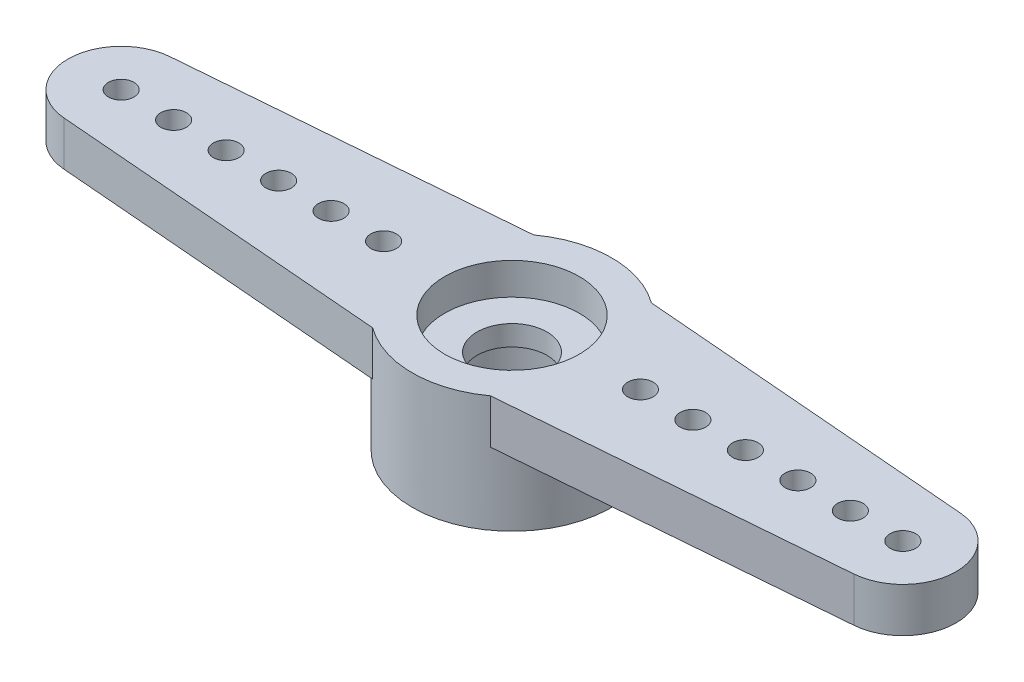
ISO-10303-21;
HEADER;
FILE_DESCRIPTION(('STEP AP214'),'2;1');
FILE_NAME('part.step','',(''),(''),'','','');
FILE_SCHEMA(('AUTOMOTIVE_DESIGN { 1 0 10303 214 1 1 1 1 }'));
ENDSEC;
DATA;
#1=APPLICATION_CONTEXT('core data for automotive mechanical design processes');
#2=APPLICATION_PROTOCOL_DEFINITION('international standard','automotive_design',2000,#1);
#3=PRODUCT_CONTEXT('',#1,'mechanical');
#4=PRODUCT('Part','Part','',(#3));
#5=PRODUCT_RELATED_PRODUCT_CATEGORY('part','',(#4));
#6=PRODUCT_DEFINITION_FORMATION('','',#4);
#7=PRODUCT_DEFINITION_CONTEXT('part definition',#1,'design');
#8=PRODUCT_DEFINITION('design','',#6,#7);
#9=PRODUCT_DEFINITION_SHAPE('','',#8);
#10=(LENGTH_UNIT() NAMED_UNIT(*) SI_UNIT(.MILLI.,.METRE.));
#11=(NAMED_UNIT(*) PLANE_ANGLE_UNIT() SI_UNIT($,.RADIAN.));
#12=(NAMED_UNIT(*) SI_UNIT($,.STERADIAN.) SOLID_ANGLE_UNIT());
#13=UNCERTAINTY_MEASURE_WITH_UNIT(LENGTH_MEASURE(1.E-05),#10,'distance_accuracy_value','');
#14=(GEOMETRIC_REPRESENTATION_CONTEXT(3) GLOBAL_UNCERTAINTY_ASSIGNED_CONTEXT((#13)) GLOBAL_UNIT_ASSIGNED_CONTEXT((#10,
#11,#12)) REPRESENTATION_CONTEXT('',''));
#15=CARTESIAN_POINT('',(0.,0.,0.));
#16=DIRECTION('',(0.,0.,1.));
#17=DIRECTION('',(1.,0.,0.));
#18=AXIS2_PLACEMENT_3D('',#15,#16,#17);
#19=CARTESIAN_POINT('',(0.,-2.6162,0.));
#20=DIRECTION('',(0.,1.,0.));
#21=DIRECTION('',(0.,0.,1.));
#22=AXIS2_PLACEMENT_3D('',#19,#20,#21);
#23=CYLINDRICAL_SURFACE('',#22,1.27);
#24=CARTESIAN_POINT('',(0.,0.4572,0.));
#25=DIRECTION('',(0.,1.,0.));
#26=DIRECTION('',(0.,0.,1.));
#27=AXIS2_PLACEMENT_3D('',#24,#25,#26);
#28=CIRCLE('',#27,1.27);
#29=CARTESIAN_POINT('',(0.,0.4572,1.27));
#30=VERTEX_POINT('',#29);
#31=EDGE_CURVE('E178',#30,#30,#28,.F.);
#32=ORIENTED_EDGE('',*,*,#31,.F.);
#33=EDGE_LOOP('',(#32));
#34=FACE_BOUND('',#33,.T.);
#35=CARTESIAN_POINT('',(0.,-0.2794,0.));
#36=DIRECTION('',(0.,-1.,0.));
#37=DIRECTION('',(0.,0.,-1.));
#38=AXIS2_PLACEMENT_3D('',#35,#36,#37);
#39=CIRCLE('',#38,1.27);
#40=CARTESIAN_POINT('',(0.,-0.2794,-1.27));
#41=VERTEX_POINT('',#40);
#42=EDGE_CURVE('E38',#41,#41,#39,.F.);
#43=ORIENTED_EDGE('',*,*,#42,.F.);
#44=EDGE_LOOP('',(#43));
#45=FACE_BOUND('',#44,.T.);
#46=ADVANCED_FACE('F34',(#34,#45),#23,.F.);
#47=CARTESIAN_POINT('',(0.,0.,0.));
#48=DIRECTION('',(0.,1.,0.));
#49=DIRECTION('',(0.,0.,1.));
#50=AXIS2_PLACEMENT_3D('',#47,#48,#49);
#51=PLANE('',#50);
#52=CARTESIAN_POINT('',(10.3759,0.,0.));
#53=DIRECTION('',(0.,1.,0.));
#54=DIRECTION('',(0.,0.,1.));
#55=AXIS2_PLACEMENT_3D('',#52,#53,#54);
#56=CIRCLE('',#55,0.46355);
#57=CARTESIAN_POINT('',(10.3759,0.,0.46355));
#58=VERTEX_POINT('',#57);
#59=EDGE_CURVE('E203',#58,#58,#56,.F.);
#60=ORIENTED_EDGE('',*,*,#59,.F.);
#61=EDGE_LOOP('',(#60));
#62=FACE_BOUND('',#61,.T.);
#63=CARTESIAN_POINT('',(6.5659,0.,0.));
#64=DIRECTION('',(0.,1.,0.));
#65=DIRECTION('',(0.,0.,1.));
#66=AXIS2_PLACEMENT_3D('',#63,#64,#65);
#67=CIRCLE('',#66,0.46355);
#68=CARTESIAN_POINT('',(6.5659,0.,0.46355));
#69=VERTEX_POINT('',#68);
#70=EDGE_CURVE('E215',#69,#69,#67,.F.);
#71=ORIENTED_EDGE('',*,*,#70,.F.);
#72=EDGE_LOOP('',(#71));
#73=FACE_BOUND('',#72,.T.);
#74=CARTESIAN_POINT('',(14.1859,0.,0.));
#75=DIRECTION('',(0.,1.,0.));
#76=DIRECTION('',(0.,0.,1.));
#77=AXIS2_PLACEMENT_3D('',#74,#75,#76);
#78=CIRCLE('',#77,0.46355);
#79=CARTESIAN_POINT('',(14.1859,0.,0.463550000000002));
#80=VERTEX_POINT('',#79);
#81=EDGE_CURVE('E227',#80,#80,#78,.F.);
#82=ORIENTED_EDGE('',*,*,#81,.F.);
#83=EDGE_LOOP('',(#82));
#84=FACE_BOUND('',#83,.T.);
#85=DIRECTION('',(0.996680450541178,0.,-0.0814130180562945));
#86=VECTOR('',#85,1.);
#87=CARTESIAN_POINT('',(14.3430596900559,0.,1.92399194172469));
#88=LINE('',#87,#86);
#89=CARTESIAN_POINT('',(2.13741415032277,0.,2.921));
#90=VERTEX_POINT('',#89);
#91=CARTESIAN_POINT('',(14.3430596900559,0.,1.92399194172469));
#92=VERTEX_POINT('',#91);
#93=EDGE_CURVE('E125',#90,#92,#88,.T.);
#94=ORIENTED_EDGE('',*,*,#93,.F.);
#95=CARTESIAN_POINT('',(0.,0.,0.));
#96=DIRECTION('',(0.,1.,0.));
#97=DIRECTION('',(0.,0.,1.));
#98=AXIS2_PLACEMENT_3D('',#95,#96,#97);
#99=CIRCLE('',#98,3.6195);
#100=CARTESIAN_POINT('',(2.13741415032277,0.,-2.921));
#101=VERTEX_POINT('',#100);
#102=EDGE_CURVE('E11',#90,#101,#99,.T.);
#103=ORIENTED_EDGE('',*,*,#102,.T.);
#104=DIRECTION('',(-0.996680450541178,0.,-0.0814130180562945));
#105=VECTOR('',#104,1.);
#106=CARTESIAN_POINT('',(2.13741415032277,0.,-2.921));
#107=LINE('',#106,#105);
#108=CARTESIAN_POINT('',(14.3430596900559,0.,-1.92399194172469));
#109=VERTEX_POINT('',#108);
#110=EDGE_CURVE('E130',#109,#101,#107,.T.);
#111=ORIENTED_EDGE('',*,*,#110,.F.);
#112=CARTESIAN_POINT('',(14.1859,0.,0.));
#113=DIRECTION('',(0.,1.,0.));
#114=DIRECTION('',(0.,0.,-1.));
#115=AXIS2_PLACEMENT_3D('',#112,#113,#114);
#116=CIRCLE('',#115,1.9304);
#117=EDGE_CURVE('E127',#92,#109,#116,.T.);
#118=ORIENTED_EDGE('',*,*,#117,.F.);
#119=EDGE_LOOP('',(#94,#103,#111,#118));
#120=FACE_BOUND('',#119,.T.);
#121=CARTESIAN_POINT('',(4.6609,0.,0.));
#122=DIRECTION('',(0.,1.,0.));
#123=DIRECTION('',(0.,0.,1.));
#124=AXIS2_PLACEMENT_3D('',#121,#122,#123);
#125=CIRCLE('',#124,0.46355);
#126=CARTESIAN_POINT('',(4.6609,0.,0.46355));
#127=VERTEX_POINT('',#126);
#128=EDGE_CURVE('E221',#127,#127,#125,.F.);
#129=ORIENTED_EDGE('',*,*,#128,.F.);
#130=EDGE_LOOP('',(#129));
#131=FACE_BOUND('',#130,.T.);
#132=CARTESIAN_POINT('',(8.4709,0.,0.));
#133=DIRECTION('',(0.,1.,0.));
#134=DIRECTION('',(0.,0.,1.));
#135=AXIS2_PLACEMENT_3D('',#132,#133,#134);
#136=CIRCLE('',#135,0.46355);
#137=CARTESIAN_POINT('',(8.4709,0.,0.46355));
#138=VERTEX_POINT('',#137);
#139=EDGE_CURVE('E209',#138,#138,#136,.F.);
#140=ORIENTED_EDGE('',*,*,#139,.F.);
#141=EDGE_LOOP('',(#140));
#142=FACE_BOUND('',#141,.T.);
#143=CARTESIAN_POINT('',(12.2809,0.,0.));
#144=DIRECTION('',(0.,1.,0.));
#145=DIRECTION('',(0.,0.,1.));
#146=AXIS2_PLACEMENT_3D('',#143,#144,#145);
#147=CIRCLE('',#146,0.46355);
#148=CARTESIAN_POINT('',(12.2809,0.,0.46355));
#149=VERTEX_POINT('',#148);
#150=EDGE_CURVE('E185',#149,#149,#147,.F.);
#151=ORIENTED_EDGE('',*,*,#150,.F.);
#152=EDGE_LOOP('',(#151));
#153=FACE_BOUND('',#152,.T.);
#154=ADVANCED_FACE('F275',(#62,#73,#84,#120,#131,#142,#153),#51,.F.);
#155=CARTESIAN_POINT('',(0.,1.6129,0.));
#156=DIRECTION('',(0.,1.,0.));
#157=DIRECTION('',(0.,0.,1.));
#158=AXIS2_PLACEMENT_3D('',#155,#156,#157);
#159=PLANE('',#158);
#160=CARTESIAN_POINT('',(0.,1.6129,0.));
#161=DIRECTION('',(0.,1.,0.));
#162=DIRECTION('',(0.,0.,1.));
#163=AXIS2_PLACEMENT_3D('',#160,#161,#162);
#164=CIRCLE('',#163,2.44475);
#165=CARTESIAN_POINT('',(0.,1.6129,2.44475));
#166=VERTEX_POINT('',#165);
#167=EDGE_CURVE('E188',#166,#166,#164,.T.);
#168=ORIENTED_EDGE('',*,*,#167,.F.);
#169=EDGE_LOOP('',(#168));
#170=FACE_BOUND('',#169,.T.);
#171=CARTESIAN_POINT('',(10.3759,1.6129,0.));
#172=DIRECTION('',(0.,-1.,0.));
#173=DIRECTION('',(0.,0.,1.));
#174=AXIS2_PLACEMENT_3D('',#171,#172,#173);
#175=CIRCLE('',#174,0.46355);
#176=CARTESIAN_POINT('',(10.3759,1.6129,0.46355));
#177=VERTEX_POINT('',#176);
#178=EDGE_CURVE('E200',#177,#177,#175,.T.);
#179=ORIENTED_EDGE('',*,*,#178,.T.);
#180=EDGE_LOOP('',(#179));
#181=FACE_BOUND('',#180,.T.);
#182=CARTESIAN_POINT('',(6.5659,1.6129,0.));
#183=DIRECTION('',(0.,-1.,0.));
#184=DIRECTION('',(0.,0.,1.));
#185=AXIS2_PLACEMENT_3D('',#182,#183,#184);
#186=CIRCLE('',#185,0.46355);
#187=CARTESIAN_POINT('',(6.5659,1.6129,0.46355));
#188=VERTEX_POINT('',#187);
#189=EDGE_CURVE('E212',#188,#188,#186,.T.);
#190=ORIENTED_EDGE('',*,*,#189,.T.);
#191=EDGE_LOOP('',(#190));
#192=FACE_BOUND('',#191,.T.);
#193=CARTESIAN_POINT('',(14.1859,1.6129,0.));
#194=DIRECTION('',(0.,-1.,0.));
#195=DIRECTION('',(0.,0.,1.));
#196=AXIS2_PLACEMENT_3D('',#193,#194,#195);
#197=CIRCLE('',#196,0.46355);
#198=CARTESIAN_POINT('',(14.1859,1.6129,0.463550000000002));
#199=VERTEX_POINT('',#198);
#200=EDGE_CURVE('E224',#199,#199,#197,.T.);
#201=ORIENTED_EDGE('',*,*,#200,.T.);
#202=EDGE_LOOP('',(#201));
#203=FACE_BOUND('',#202,.T.);
#204=CARTESIAN_POINT('',(-12.2809,1.6129,0.));
#205=DIRECTION('',(0.,1.,0.));
#206=DIRECTION('',(0.,0.,1.));
#207=AXIS2_PLACEMENT_3D('',#204,#205,#206);
#208=CIRCLE('',#207,0.46355);
#209=CARTESIAN_POINT('',(-12.2809,1.6129,0.46355));
#210=VERTEX_POINT('',#209);
#211=EDGE_CURVE('E177',#210,#210,#208,.T.);
#212=ORIENTED_EDGE('',*,*,#211,.F.);
#213=EDGE_LOOP('',(#212));
#214=FACE_BOUND('',#213,.T.);
#215=CARTESIAN_POINT('',(-10.3759,1.6129,0.));
#216=DIRECTION('',(0.,1.,0.));
#217=DIRECTION('',(0.,0.,1.));
#218=AXIS2_PLACEMENT_3D('',#215,#216,#217);
#219=CIRCLE('',#218,0.46355);
#220=CARTESIAN_POINT('',(-10.3759,1.6129,0.46355));
#221=VERTEX_POINT('',#220);
#222=EDGE_CURVE('E174',#221,#221,#219,.T.);
#223=ORIENTED_EDGE('',*,*,#222,.F.);
#224=EDGE_LOOP('',(#223));
#225=FACE_BOUND('',#224,.T.);
#226=CARTESIAN_POINT('',(-8.4709,1.6129,0.));
#227=DIRECTION('',(0.,1.,0.));
#228=DIRECTION('',(0.,0.,1.));
#229=AXIS2_PLACEMENT_3D('',#226,#227,#228);
#230=CIRCLE('',#229,0.46355);
#231=CARTESIAN_POINT('',(-8.4709,1.6129,0.46355));
#232=VERTEX_POINT('',#231);
#233=EDGE_CURVE('E170',#232,#232,#230,.T.);
#234=ORIENTED_EDGE('',*,*,#233,.F.);
#235=EDGE_LOOP('',(#234));
#236=FACE_BOUND('',#235,.T.);
#237=CARTESIAN_POINT('',(-6.5659,1.6129,0.));
#238=DIRECTION('',(0.,1.,0.));
#239=DIRECTION('',(0.,0.,1.));
#240=AXIS2_PLACEMENT_3D('',#237,#238,#239);
#241=CIRCLE('',#240,0.46355);
#242=CARTESIAN_POINT('',(-6.5659,1.6129,0.46355));
#243=VERTEX_POINT('',#242);
#244=EDGE_CURVE('E166',#243,#243,#241,.T.);
#245=ORIENTED_EDGE('',*,*,#244,.F.);
#246=EDGE_LOOP('',(#245));
#247=FACE_BOUND('',#246,.T.);
#248=CARTESIAN_POINT('',(-4.6609,1.6129,0.));
#249=DIRECTION('',(0.,1.,0.));
#250=DIRECTION('',(0.,0.,1.));
#251=AXIS2_PLACEMENT_3D('',#248,#249,#250);
#252=CIRCLE('',#251,0.46355);
#253=CARTESIAN_POINT('',(-4.6609,1.6129,0.46355));
#254=VERTEX_POINT('',#253);
#255=EDGE_CURVE('E162',#254,#254,#252,.T.);
#256=ORIENTED_EDGE('',*,*,#255,.F.);
#257=EDGE_LOOP('',(#256));
#258=FACE_BOUND('',#257,.T.);
#259=CARTESIAN_POINT('',(-14.1859,1.6129,0.));
#260=DIRECTION('',(0.,1.,0.));
#261=DIRECTION('',(0.,0.,1.));
#262=AXIS2_PLACEMENT_3D('',#259,#260,#261);
#263=CIRCLE('',#262,0.46355);
#264=CARTESIAN_POINT('',(-14.1859,1.6129,0.463550000000002));
#265=VERTEX_POINT('',#264);
#266=EDGE_CURVE('E158',#265,#265,#263,.T.);
#267=ORIENTED_EDGE('',*,*,#266,.F.);
#268=EDGE_LOOP('',(#267));
#269=FACE_BOUND('',#268,.T.);
#270=DIRECTION('',(0.996680450541178,0.,0.0814130180562944));
#271=VECTOR('',#270,1.);
#272=CARTESIAN_POINT('',(-14.3430596900559,1.6129,1.92399194172469));
#273=LINE('',#272,#271);
#274=CARTESIAN_POINT('',(-14.3430596900559,1.6129,1.92399194172469));
#275=VERTEX_POINT('',#274);
#276=CARTESIAN_POINT('',(-2.13741415032276,1.6129,2.921));
#277=VERTEX_POINT('',#276);
#278=EDGE_CURVE('E53',#275,#277,#273,.T.);
#279=ORIENTED_EDGE('',*,*,#278,.T.);
#280=CARTESIAN_POINT('',(0.,1.6129,0.));
#281=DIRECTION('',(0.,1.,0.));
#282=DIRECTION('',(0.,0.,1.));
#283=AXIS2_PLACEMENT_3D('',#280,#281,#282);
#284=CIRCLE('',#283,3.6195);
#285=CARTESIAN_POINT('',(2.13741415032277,1.6129,2.921));
#286=VERTEX_POINT('',#285);
#287=EDGE_CURVE('E138',#277,#286,#284,.T.);
#288=ORIENTED_EDGE('',*,*,#287,.T.);
#289=DIRECTION('',(0.996680450541178,0.,-0.0814130180562945));
#290=VECTOR('',#289,1.);
#291=CARTESIAN_POINT('',(14.3430596900559,1.6129,1.92399194172469));
#292=LINE('',#291,#290);
#293=CARTESIAN_POINT('',(14.3430596900559,1.6129,1.92399194172469));
#294=VERTEX_POINT('',#293);
#295=EDGE_CURVE('E90',#286,#294,#292,.T.);
#296=ORIENTED_EDGE('',*,*,#295,.T.);
#297=CARTESIAN_POINT('',(14.1859,1.6129,0.));
#298=DIRECTION('',(0.,1.,0.));
#299=DIRECTION('',(0.,0.,-1.));
#300=AXIS2_PLACEMENT_3D('',#297,#298,#299);
#301=CIRCLE('',#300,1.9304);
#302=CARTESIAN_POINT('',(14.3430596900559,1.6129,-1.92399194172469));
#303=VERTEX_POINT('',#302);
#304=EDGE_CURVE('E246',#294,#303,#301,.T.);
#305=ORIENTED_EDGE('',*,*,#304,.T.);
#306=DIRECTION('',(-0.996680450541178,0.,-0.0814130180562945));
#307=VECTOR('',#306,1.);
#308=CARTESIAN_POINT('',(2.13741415032277,1.6129,-2.921));
#309=LINE('',#308,#307);
#310=CARTESIAN_POINT('',(2.13741415032277,1.6129,-2.921));
#311=VERTEX_POINT('',#310);
#312=EDGE_CURVE('E248',#303,#311,#309,.T.);
#313=ORIENTED_EDGE('',*,*,#312,.T.);
#314=CARTESIAN_POINT('',(0.,1.6129,0.));
#315=DIRECTION('',(0.,1.,0.));
#316=DIRECTION('',(0.,0.,1.));
#317=AXIS2_PLACEMENT_3D('',#314,#315,#316);
#318=CIRCLE('',#317,3.6195);
#319=CARTESIAN_POINT('',(-2.13741415032276,1.6129,-2.921));
#320=VERTEX_POINT('',#319);
#321=EDGE_CURVE('E111',#311,#320,#318,.T.);
#322=ORIENTED_EDGE('',*,*,#321,.T.);
#323=DIRECTION('',(-0.996680450541178,0.,0.0814130180562946));
#324=VECTOR('',#323,1.);
#325=CARTESIAN_POINT('',(-14.3430596900559,1.6129,-1.92399194172469));
#326=LINE('',#325,#324);
#327=CARTESIAN_POINT('',(-14.3430596900559,1.6129,-1.92399194172469));
#328=VERTEX_POINT('',#327);
#329=EDGE_CURVE('E105',#320,#328,#326,.T.);
#330=ORIENTED_EDGE('',*,*,#329,.T.);
#331=CARTESIAN_POINT('',(-14.1859,1.6129,0.));
#332=DIRECTION('',(0.,1.,0.));
#333=DIRECTION('',(0.,0.,1.));
#334=AXIS2_PLACEMENT_3D('',#331,#332,#333);
#335=CIRCLE('',#334,1.9304);
#336=EDGE_CURVE('E109',#328,#275,#335,.T.);
#337=ORIENTED_EDGE('',*,*,#336,.T.);
#338=EDGE_LOOP('',(#279,#288,#296,#305,#313,#322,#330,#337));
#339=FACE_BOUND('',#338,.T.);
#340=CARTESIAN_POINT('',(4.6609,1.6129,0.));
#341=DIRECTION('',(0.,-1.,0.));
#342=DIRECTION('',(0.,0.,1.));
#343=AXIS2_PLACEMENT_3D('',#340,#341,#342);
#344=CIRCLE('',#343,0.46355);
#345=CARTESIAN_POINT('',(4.6609,1.6129,0.46355));
#346=VERTEX_POINT('',#345);
#347=EDGE_CURVE('E218',#346,#346,#344,.T.);
#348=ORIENTED_EDGE('',*,*,#347,.T.);
#349=EDGE_LOOP('',(#348));
#350=FACE_BOUND('',#349,.T.);
#351=CARTESIAN_POINT('',(8.4709,1.6129,0.));
#352=DIRECTION('',(0.,-1.,0.));
#353=DIRECTION('',(0.,0.,1.));
#354=AXIS2_PLACEMENT_3D('',#351,#352,#353);
#355=CIRCLE('',#354,0.46355);
#356=CARTESIAN_POINT('',(8.4709,1.6129,0.46355));
#357=VERTEX_POINT('',#356);
#358=EDGE_CURVE('E206',#357,#357,#355,.T.);
#359=ORIENTED_EDGE('',*,*,#358,.T.);
#360=EDGE_LOOP('',(#359));
#361=FACE_BOUND('',#360,.T.);
#362=CARTESIAN_POINT('',(12.2809,1.6129,0.));
#363=DIRECTION('',(0.,-1.,0.));
#364=DIRECTION('',(0.,0.,1.));
#365=AXIS2_PLACEMENT_3D('',#362,#363,#364);
#366=CIRCLE('',#365,0.46355);
#367=CARTESIAN_POINT('',(12.2809,1.6129,0.46355));
#368=VERTEX_POINT('',#367);
#369=EDGE_CURVE('E180',#368,#368,#366,.T.);
#370=ORIENTED_EDGE('',*,*,#369,.T.);
#371=EDGE_LOOP('',(#370));
#372=FACE_BOUND('',#371,.T.);
#373=ADVANCED_FACE('F106',(#170,#181,#192,#203,#214,#225,#236,#247,#258,#269,#339,#350,#361,
#372),#159,.T.);
#374=CARTESIAN_POINT('',(14.3430596900559,1.6129,1.92399194172469));
#375=DIRECTION('',(-0.0814130180562945,0.,-0.996680450541178));
#376=DIRECTION('',(-0.996680450541178,0.,0.0814130180562945));
#377=AXIS2_PLACEMENT_3D('',#374,#375,#376);
#378=PLANE('',#377);
#379=ORIENTED_EDGE('',*,*,#93,.T.);
#380=DIRECTION('',(0.,-1.,0.));
#381=VECTOR('',#380,1.);
#382=CARTESIAN_POINT('',(14.3430596900559,1.6129,1.92399194172469));
#383=LINE('',#382,#381);
#384=EDGE_CURVE('E149',#294,#92,#383,.T.);
#385=ORIENTED_EDGE('',*,*,#384,.F.);
#386=ORIENTED_EDGE('',*,*,#295,.F.);
#387=DIRECTION('',(0.,-1.,0.));
#388=VECTOR('',#387,1.);
#389=CARTESIAN_POINT('',(2.13741415032277,1.6129,2.921));
#390=LINE('',#389,#388);
#391=EDGE_CURVE('E152',#286,#90,#390,.T.);
#392=ORIENTED_EDGE('',*,*,#391,.T.);
#393=EDGE_LOOP('',(#379,#385,#386,#392));
#394=FACE_BOUND('',#393,.T.);
#395=ADVANCED_FACE('F36',(#394),#378,.F.);
#396=CARTESIAN_POINT('',(14.1859,1.6129,0.));
#397=DIRECTION('',(0.,-1.,0.));
#398=DIRECTION('',(0.,0.,-1.));
#399=AXIS2_PLACEMENT_3D('',#396,#397,#398);
#400=CYLINDRICAL_SURFACE('',#399,1.9304);
#401=ORIENTED_EDGE('',*,*,#117,.T.);
#402=DIRECTION('',(0.,-1.,0.));
#403=VECTOR('',#402,1.);
#404=CARTESIAN_POINT('',(14.3430596900559,1.6129,-1.92399194172469));
#405=LINE('',#404,#403);
#406=EDGE_CURVE('E146',#303,#109,#405,.T.);
#407=ORIENTED_EDGE('',*,*,#406,.F.);
#408=ORIENTED_EDGE('',*,*,#304,.F.);
#409=ORIENTED_EDGE('',*,*,#384,.T.);
#410=EDGE_LOOP('',(#401,#407,#408,#409));
#411=FACE_BOUND('',#410,.T.);
#412=ADVANCED_FACE('F273',(#411),#400,.T.);
#413=CARTESIAN_POINT('',(2.13741415032277,1.6129,-2.921));
#414=DIRECTION('',(-0.0814130180562945,0.,0.996680450541178));
#415=DIRECTION('',(0.996680450541178,0.,0.0814130180562945));
#416=AXIS2_PLACEMENT_3D('',#413,#414,#415);
#417=PLANE('',#416);
#418=ORIENTED_EDGE('',*,*,#110,.T.);
#419=DIRECTION('',(0.,-1.,0.));
#420=VECTOR('',#419,1.);
#421=CARTESIAN_POINT('',(2.13741415032277,1.6129,-2.921));
#422=LINE('',#421,#420);
#423=EDGE_CURVE('E143',#311,#101,#422,.T.);
#424=ORIENTED_EDGE('',*,*,#423,.F.);
#425=ORIENTED_EDGE('',*,*,#312,.F.);
#426=ORIENTED_EDGE('',*,*,#406,.T.);
#427=EDGE_LOOP('',(#418,#424,#425,#426));
#428=FACE_BOUND('',#427,.T.);
#429=ADVANCED_FACE('F254',(#428),#417,.F.);
#430=CARTESIAN_POINT('',(0.,1.6129,0.));
#431=DIRECTION('',(0.,-1.,0.));
#432=DIRECTION('',(0.,0.,-1.));
#433=AXIS2_PLACEMENT_3D('',#430,#431,#432);
#434=CYLINDRICAL_SURFACE('',#433,3.6195);
#435=ORIENTED_EDGE('',*,*,#423,.T.);
#436=ORIENTED_EDGE('',*,*,#102,.F.);
#437=ORIENTED_EDGE('',*,*,#391,.F.);
#438=ORIENTED_EDGE('',*,*,#287,.F.);
#439=DIRECTION('',(0.,-1.,0.));
#440=VECTOR('',#439,1.);
#441=CARTESIAN_POINT('',(-2.13741415032276,1.6129,2.921));
#442=LINE('',#441,#440);
#443=CARTESIAN_POINT('',(-2.13741415032277,0.,2.921));
#444=VERTEX_POINT('',#443);
#445=EDGE_CURVE('E121',#277,#444,#442,.T.);
#446=ORIENTED_EDGE('',*,*,#445,.T.);
#447=CARTESIAN_POINT('',(-2.13741415032276,0.,-2.921));
#448=VERTEX_POINT('',#447);
#449=EDGE_CURVE('E44',#448,#444,#99,.T.);
#450=ORIENTED_EDGE('',*,*,#449,.F.);
#451=DIRECTION('',(0.,-1.,0.));
#452=VECTOR('',#451,1.);
#453=CARTESIAN_POINT('',(-2.13741415032276,1.6129,-2.921));
#454=LINE('',#453,#452);
#455=EDGE_CURVE('E116',#320,#448,#454,.T.);
#456=ORIENTED_EDGE('',*,*,#455,.F.);
#457=ORIENTED_EDGE('',*,*,#321,.F.);
#458=EDGE_LOOP('',(#435,#436,#437,#438,#446,#450,#456,#457));
#459=FACE_BOUND('',#458,.T.);
#460=CARTESIAN_POINT('',(0.,-2.6162,0.));
#461=DIRECTION('',(0.,1.,0.));
#462=DIRECTION('',(0.,0.,1.));
#463=AXIS2_PLACEMENT_3D('',#460,#461,#462);
#464=CIRCLE('',#463,3.6195);
#465=CARTESIAN_POINT('',(0.,-2.6162,3.6195));
#466=VERTEX_POINT('',#465);
#467=EDGE_CURVE('E128',#466,#466,#464,.T.);
#468=ORIENTED_EDGE('',*,*,#467,.T.);
#469=EDGE_LOOP('',(#468));
#470=FACE_BOUND('',#469,.T.);
#471=ADVANCED_FACE('F257',(#459,#470),#434,.T.);
#472=CARTESIAN_POINT('',(-14.3430596900559,1.6129,-1.92399194172469));
#473=DIRECTION('',(0.0814130180562946,0.,0.996680450541178));
#474=DIRECTION('',(0.996680450541178,0.,-0.0814130180562946));
#475=AXIS2_PLACEMENT_3D('',#472,#473,#474);
#476=PLANE('',#475);
#477=DIRECTION('',(-0.996680450541178,0.,0.0814130180562946));
#478=VECTOR('',#477,1.);
#479=CARTESIAN_POINT('',(-14.3430596900559,0.,-1.92399194172469));
#480=LINE('',#479,#478);
#481=CARTESIAN_POINT('',(-14.3430596900559,0.,-1.92399194172469));
#482=VERTEX_POINT('',#481);
#483=EDGE_CURVE('E74',#448,#482,#480,.T.);
#484=ORIENTED_EDGE('',*,*,#483,.T.);
#485=DIRECTION('',(0.,-1.,0.));
#486=VECTOR('',#485,1.);
#487=CARTESIAN_POINT('',(-14.3430596900559,1.6129,-1.92399194172469));
#488=LINE('',#487,#486);
#489=EDGE_CURVE('E114',#328,#482,#488,.T.);
#490=ORIENTED_EDGE('',*,*,#489,.F.);
#491=ORIENTED_EDGE('',*,*,#329,.F.);
#492=ORIENTED_EDGE('',*,*,#455,.T.);
#493=EDGE_LOOP('',(#484,#490,#491,#492));
#494=FACE_BOUND('',#493,.T.);
#495=ADVANCED_FACE('F115',(#494),#476,.F.);
#496=CARTESIAN_POINT('',(-14.1859,1.6129,0.));
#497=DIRECTION('',(0.,-1.,0.));
#498=DIRECTION('',(0.,0.,-1.));
#499=AXIS2_PLACEMENT_3D('',#496,#497,#498);
#500=CYLINDRICAL_SURFACE('',#499,1.9304);
#501=CARTESIAN_POINT('',(-14.1859,0.,0.));
#502=DIRECTION('',(0.,1.,0.));
#503=DIRECTION('',(0.,0.,1.));
#504=AXIS2_PLACEMENT_3D('',#501,#502,#503);
#505=CIRCLE('',#504,1.9304);
#506=CARTESIAN_POINT('',(-14.3430596900559,0.,1.92399194172469));
#507=VERTEX_POINT('',#506);
#508=EDGE_CURVE('E81',#482,#507,#505,.T.);
#509=ORIENTED_EDGE('',*,*,#508,.T.);
#510=DIRECTION('',(0.,-1.,0.));
#511=VECTOR('',#510,1.);
#512=CARTESIAN_POINT('',(-14.3430596900559,1.6129,1.92399194172469));
#513=LINE('',#512,#511);
#514=EDGE_CURVE('E117',#275,#507,#513,.T.);
#515=ORIENTED_EDGE('',*,*,#514,.F.);
#516=ORIENTED_EDGE('',*,*,#336,.F.);
#517=ORIENTED_EDGE('',*,*,#489,.T.);
#518=EDGE_LOOP('',(#509,#515,#516,#517));
#519=FACE_BOUND('',#518,.T.);
#520=ADVANCED_FACE('F119',(#519),#500,.T.);
#521=CARTESIAN_POINT('',(-14.3430596900559,1.6129,1.92399194172469));
#522=DIRECTION('',(0.0814130180562944,0.,-0.996680450541178));
#523=DIRECTION('',(-0.996680450541178,0.,-0.0814130180562944));
#524=AXIS2_PLACEMENT_3D('',#521,#522,#523);
#525=PLANE('',#524);
#526=DIRECTION('',(0.996680450541178,0.,0.0814130180562944));
#527=VECTOR('',#526,1.);
#528=CARTESIAN_POINT('',(-14.3430596900559,0.,1.92399194172469));
#529=LINE('',#528,#527);
#530=EDGE_CURVE('E135',#507,#444,#529,.T.);
#531=ORIENTED_EDGE('',*,*,#530,.T.);
#532=ORIENTED_EDGE('',*,*,#445,.F.);
#533=ORIENTED_EDGE('',*,*,#278,.F.);
#534=ORIENTED_EDGE('',*,*,#514,.T.);
#535=EDGE_LOOP('',(#531,#532,#533,#534));
#536=FACE_BOUND('',#535,.T.);
#537=ADVANCED_FACE('F266',(#536),#525,.F.);
#538=CARTESIAN_POINT('',(-12.2809,0.,0.));
#539=DIRECTION('',(0.,1.,0.));
#540=DIRECTION('',(0.,0.,1.));
#541=AXIS2_PLACEMENT_3D('',#538,#539,#540);
#542=CIRCLE('',#541,0.46355);
#543=CARTESIAN_POINT('',(-12.2809,0.,0.46355));
#544=VERTEX_POINT('',#543);
#545=EDGE_CURVE('E175',#544,#544,#542,.T.);
#546=ORIENTED_EDGE('',*,*,#545,.T.);
#547=EDGE_LOOP('',(#546));
#548=FACE_BOUND('',#547,.T.);
#549=CARTESIAN_POINT('',(-10.3759,0.,0.));
#550=DIRECTION('',(0.,1.,0.));
#551=DIRECTION('',(0.,0.,1.));
#552=AXIS2_PLACEMENT_3D('',#549,#550,#551);
#553=CIRCLE('',#552,0.46355);
#554=CARTESIAN_POINT('',(-10.3759,0.,0.46355));
#555=VERTEX_POINT('',#554);
#556=EDGE_CURVE('E171',#555,#555,#553,.T.);
#557=ORIENTED_EDGE('',*,*,#556,.T.);
#558=EDGE_LOOP('',(#557));
#559=FACE_BOUND('',#558,.T.);
#560=CARTESIAN_POINT('',(-8.4709,0.,0.));
#561=DIRECTION('',(0.,1.,0.));
#562=DIRECTION('',(0.,0.,1.));
#563=AXIS2_PLACEMENT_3D('',#560,#561,#562);
#564=CIRCLE('',#563,0.46355);
#565=CARTESIAN_POINT('',(-8.4709,0.,0.46355));
#566=VERTEX_POINT('',#565);
#567=EDGE_CURVE('E167',#566,#566,#564,.T.);
#568=ORIENTED_EDGE('',*,*,#567,.T.);
#569=EDGE_LOOP('',(#568));
#570=FACE_BOUND('',#569,.T.);
#571=CARTESIAN_POINT('',(-6.5659,0.,0.));
#572=DIRECTION('',(0.,1.,0.));
#573=DIRECTION('',(0.,0.,1.));
#574=AXIS2_PLACEMENT_3D('',#571,#572,#573);
#575=CIRCLE('',#574,0.46355);
#576=CARTESIAN_POINT('',(-6.5659,0.,0.46355));
#577=VERTEX_POINT('',#576);
#578=EDGE_CURVE('E163',#577,#577,#575,.T.);
#579=ORIENTED_EDGE('',*,*,#578,.T.);
#580=EDGE_LOOP('',(#579));
#581=FACE_BOUND('',#580,.T.);
#582=CARTESIAN_POINT('',(-4.6609,0.,0.));
#583=DIRECTION('',(0.,1.,0.));
#584=DIRECTION('',(0.,0.,1.));
#585=AXIS2_PLACEMENT_3D('',#582,#583,#584);
#586=CIRCLE('',#585,0.46355);
#587=CARTESIAN_POINT('',(-4.6609,0.,0.46355));
#588=VERTEX_POINT('',#587);
#589=EDGE_CURVE('E159',#588,#588,#586,.T.);
#590=ORIENTED_EDGE('',*,*,#589,.T.);
#591=EDGE_LOOP('',(#590));
#592=FACE_BOUND('',#591,.T.);
#593=CARTESIAN_POINT('',(-14.1859,0.,0.));
#594=DIRECTION('',(0.,1.,0.));
#595=DIRECTION('',(0.,0.,1.));
#596=AXIS2_PLACEMENT_3D('',#593,#594,#595);
#597=CIRCLE('',#596,0.46355);
#598=CARTESIAN_POINT('',(-14.1859,0.,0.463550000000002));
#599=VERTEX_POINT('',#598);
#600=EDGE_CURVE('E155',#599,#599,#597,.T.);
#601=ORIENTED_EDGE('',*,*,#600,.T.);
#602=EDGE_LOOP('',(#601));
#603=FACE_BOUND('',#602,.T.);
#604=ORIENTED_EDGE('',*,*,#483,.F.);
#605=ORIENTED_EDGE('',*,*,#449,.T.);
#606=ORIENTED_EDGE('',*,*,#530,.F.);
#607=ORIENTED_EDGE('',*,*,#508,.F.);
#608=EDGE_LOOP('',(#604,#605,#606,#607));
#609=FACE_BOUND('',#608,.T.);
#610=ADVANCED_FACE('F263',(#548,#559,#570,#581,#592,#603,#609),#51,.F.);
#611=CARTESIAN_POINT('',(0.,-2.6162,0.));
#612=DIRECTION('',(0.,1.,0.));
#613=DIRECTION('',(0.,0.,1.));
#614=AXIS2_PLACEMENT_3D('',#611,#612,#613);
#615=PLANE('',#614);
#616=CARTESIAN_POINT('',(0.,-2.6162,0.));
#617=DIRECTION('',(0.,-1.,0.));
#618=DIRECTION('',(0.,0.,-1.));
#619=AXIS2_PLACEMENT_3D('',#616,#617,#618);
#620=CIRCLE('',#619,2.286);
#621=CARTESIAN_POINT('',(0.,-2.6162,-2.286));
#622=VERTEX_POINT('',#621);
#623=EDGE_CURVE('E195',#622,#622,#620,.T.);
#624=ORIENTED_EDGE('',*,*,#623,.F.);
#625=EDGE_LOOP('',(#624));
#626=FACE_BOUND('',#625,.T.);
#627=ORIENTED_EDGE('',*,*,#467,.F.);
#628=EDGE_LOOP('',(#627));
#629=FACE_BOUND('',#628,.T.);
#630=ADVANCED_FACE('F316',(#626,#629),#615,.F.);
#631=CARTESIAN_POINT('',(-14.1859,-2.6162,0.));
#632=DIRECTION('',(0.,1.,0.));
#633=DIRECTION('',(0.,0.,1.));
#634=AXIS2_PLACEMENT_3D('',#631,#632,#633);
#635=CYLINDRICAL_SURFACE('',#634,0.46355);
#636=ORIENTED_EDGE('',*,*,#266,.T.);
#637=EDGE_LOOP('',(#636));
#638=FACE_BOUND('',#637,.T.);
#639=ORIENTED_EDGE('',*,*,#600,.F.);
#640=EDGE_LOOP('',(#639));
#641=FACE_BOUND('',#640,.T.);
#642=ADVANCED_FACE('F313',(#638,#641),#635,.F.);
#643=CARTESIAN_POINT('',(-4.6609,-2.6162,0.));
#644=DIRECTION('',(0.,1.,0.));
#645=DIRECTION('',(0.,0.,1.));
#646=AXIS2_PLACEMENT_3D('',#643,#644,#645);
#647=CYLINDRICAL_SURFACE('',#646,0.46355);
#648=ORIENTED_EDGE('',*,*,#255,.T.);
#649=EDGE_LOOP('',(#648));
#650=FACE_BOUND('',#649,.T.);
#651=ORIENTED_EDGE('',*,*,#589,.F.);
#652=EDGE_LOOP('',(#651));
#653=FACE_BOUND('',#652,.T.);
#654=ADVANCED_FACE('F311',(#650,#653),#647,.F.);
#655=CARTESIAN_POINT('',(-6.5659,-2.6162,0.));
#656=DIRECTION('',(0.,1.,0.));
#657=DIRECTION('',(0.,0.,1.));
#658=AXIS2_PLACEMENT_3D('',#655,#656,#657);
#659=CYLINDRICAL_SURFACE('',#658,0.46355);
#660=ORIENTED_EDGE('',*,*,#244,.T.);
#661=EDGE_LOOP('',(#660));
#662=FACE_BOUND('',#661,.T.);
#663=ORIENTED_EDGE('',*,*,#578,.F.);
#664=EDGE_LOOP('',(#663));
#665=FACE_BOUND('',#664,.T.);
#666=ADVANCED_FACE('F484',(#662,#665),#659,.F.);
#667=CARTESIAN_POINT('',(-8.4709,-2.6162,0.));
#668=DIRECTION('',(0.,1.,0.));
#669=DIRECTION('',(0.,0.,1.));
#670=AXIS2_PLACEMENT_3D('',#667,#668,#669);
#671=CYLINDRICAL_SURFACE('',#670,0.46355);
#672=ORIENTED_EDGE('',*,*,#233,.T.);
#673=EDGE_LOOP('',(#672));
#674=FACE_BOUND('',#673,.T.);
#675=ORIENTED_EDGE('',*,*,#567,.F.);
#676=EDGE_LOOP('',(#675));
#677=FACE_BOUND('',#676,.T.);
#678=ADVANCED_FACE('F491',(#674,#677),#671,.F.);
#679=CARTESIAN_POINT('',(-10.3759,-2.6162,0.));
#680=DIRECTION('',(0.,1.,0.));
#681=DIRECTION('',(0.,0.,1.));
#682=AXIS2_PLACEMENT_3D('',#679,#680,#681);
#683=CYLINDRICAL_SURFACE('',#682,0.46355);
#684=ORIENTED_EDGE('',*,*,#222,.T.);
#685=EDGE_LOOP('',(#684));
#686=FACE_BOUND('',#685,.T.);
#687=ORIENTED_EDGE('',*,*,#556,.F.);
#688=EDGE_LOOP('',(#687));
#689=FACE_BOUND('',#688,.T.);
#690=ADVANCED_FACE('F498',(#686,#689),#683,.F.);
#691=CARTESIAN_POINT('',(-12.2809,-2.6162,0.));
#692=DIRECTION('',(0.,1.,0.));
#693=DIRECTION('',(0.,0.,1.));
#694=AXIS2_PLACEMENT_3D('',#691,#692,#693);
#695=CYLINDRICAL_SURFACE('',#694,0.46355);
#696=ORIENTED_EDGE('',*,*,#211,.T.);
#697=EDGE_LOOP('',(#696));
#698=FACE_BOUND('',#697,.T.);
#699=ORIENTED_EDGE('',*,*,#545,.F.);
#700=EDGE_LOOP('',(#699));
#701=FACE_BOUND('',#700,.T.);
#702=ADVANCED_FACE('F360',(#698,#701),#695,.F.);
#703=CARTESIAN_POINT('',(14.1859,-2.6162,0.));
#704=DIRECTION('',(0.,1.,0.));
#705=DIRECTION('',(0.,0.,1.));
#706=AXIS2_PLACEMENT_3D('',#703,#704,#705);
#707=CYLINDRICAL_SURFACE('',#706,0.46355);
#708=ORIENTED_EDGE('',*,*,#200,.F.);
#709=EDGE_LOOP('',(#708));
#710=FACE_BOUND('',#709,.T.);
#711=ORIENTED_EDGE('',*,*,#81,.T.);
#712=EDGE_LOOP('',(#711));
#713=FACE_BOUND('',#712,.T.);
#714=ADVANCED_FACE('F365',(#710,#713),#707,.F.);
#715=CARTESIAN_POINT('',(4.6609,-2.6162,0.));
#716=DIRECTION('',(0.,1.,0.));
#717=DIRECTION('',(0.,0.,1.));
#718=AXIS2_PLACEMENT_3D('',#715,#716,#717);
#719=CYLINDRICAL_SURFACE('',#718,0.46355);
#720=ORIENTED_EDGE('',*,*,#347,.F.);
#721=EDGE_LOOP('',(#720));
#722=FACE_BOUND('',#721,.T.);
#723=ORIENTED_EDGE('',*,*,#128,.T.);
#724=EDGE_LOOP('',(#723));
#725=FACE_BOUND('',#724,.T.);
#726=ADVANCED_FACE('F370',(#722,#725),#719,.F.);
#727=CARTESIAN_POINT('',(6.5659,-2.6162,0.));
#728=DIRECTION('',(0.,1.,0.));
#729=DIRECTION('',(0.,0.,1.));
#730=AXIS2_PLACEMENT_3D('',#727,#728,#729);
#731=CYLINDRICAL_SURFACE('',#730,0.46355);
#732=ORIENTED_EDGE('',*,*,#189,.F.);
#733=EDGE_LOOP('',(#732));
#734=FACE_BOUND('',#733,.T.);
#735=ORIENTED_EDGE('',*,*,#70,.T.);
#736=EDGE_LOOP('',(#735));
#737=FACE_BOUND('',#736,.T.);
#738=ADVANCED_FACE('F382',(#734,#737),#731,.F.);
#739=CARTESIAN_POINT('',(8.4709,-2.6162,0.));
#740=DIRECTION('',(0.,1.,0.));
#741=DIRECTION('',(0.,0.,1.));
#742=AXIS2_PLACEMENT_3D('',#739,#740,#741);
#743=CYLINDRICAL_SURFACE('',#742,0.46355);
#744=ORIENTED_EDGE('',*,*,#358,.F.);
#745=EDGE_LOOP('',(#744));
#746=FACE_BOUND('',#745,.T.);
#747=ORIENTED_EDGE('',*,*,#139,.T.);
#748=EDGE_LOOP('',(#747));
#749=FACE_BOUND('',#748,.T.);
#750=ADVANCED_FACE('F298',(#746,#749),#743,.F.);
#751=CARTESIAN_POINT('',(10.3759,-2.6162,0.));
#752=DIRECTION('',(0.,1.,0.));
#753=DIRECTION('',(0.,0.,1.));
#754=AXIS2_PLACEMENT_3D('',#751,#752,#753);
#755=CYLINDRICAL_SURFACE('',#754,0.46355);
#756=ORIENTED_EDGE('',*,*,#178,.F.);
#757=EDGE_LOOP('',(#756));
#758=FACE_BOUND('',#757,.T.);
#759=ORIENTED_EDGE('',*,*,#59,.T.);
#760=EDGE_LOOP('',(#759));
#761=FACE_BOUND('',#760,.T.);
#762=ADVANCED_FACE('F289',(#758,#761),#755,.F.);
#763=CARTESIAN_POINT('',(12.2809,-2.6162,0.));
#764=DIRECTION('',(0.,1.,0.));
#765=DIRECTION('',(0.,0.,1.));
#766=AXIS2_PLACEMENT_3D('',#763,#764,#765);
#767=CYLINDRICAL_SURFACE('',#766,0.46355);
#768=ORIENTED_EDGE('',*,*,#369,.F.);
#769=EDGE_LOOP('',(#768));
#770=FACE_BOUND('',#769,.T.);
#771=ORIENTED_EDGE('',*,*,#150,.T.);
#772=EDGE_LOOP('',(#771));
#773=FACE_BOUND('',#772,.T.);
#774=ADVANCED_FACE('F286',(#770,#773),#767,.F.);
#775=CARTESIAN_POINT('',(0.,0.4572,0.));
#776=DIRECTION('',(0.,1.,0.));
#777=DIRECTION('',(0.,0.,1.));
#778=AXIS2_PLACEMENT_3D('',#775,#776,#777);
#779=PLANE('',#778);
#780=CARTESIAN_POINT('',(0.,0.4572,0.));
#781=DIRECTION('',(0.,1.,0.));
#782=DIRECTION('',(0.,0.,1.));
#783=AXIS2_PLACEMENT_3D('',#780,#781,#782);
#784=CIRCLE('',#783,2.44475);
#785=CARTESIAN_POINT('',(0.,0.4572,2.44475));
#786=VERTEX_POINT('',#785);
#787=EDGE_CURVE('E181',#786,#786,#784,.T.);
#788=ORIENTED_EDGE('',*,*,#787,.T.);
#789=EDGE_LOOP('',(#788));
#790=FACE_BOUND('',#789,.T.);
#791=ORIENTED_EDGE('',*,*,#31,.T.);
#792=EDGE_LOOP('',(#791));
#793=FACE_BOUND('',#792,.T.);
#794=ADVANCED_FACE('F288',(#790,#793),#779,.T.);
#795=CARTESIAN_POINT('',(0.,0.4572,0.));
#796=DIRECTION('',(0.,1.,0.));
#797=DIRECTION('',(0.,0.,1.));
#798=AXIS2_PLACEMENT_3D('',#795,#796,#797);
#799=CYLINDRICAL_SURFACE('',#798,2.44475);
#800=ORIENTED_EDGE('',*,*,#787,.F.);
#801=EDGE_LOOP('',(#800));
#802=FACE_BOUND('',#801,.T.);
#803=ORIENTED_EDGE('',*,*,#167,.T.);
#804=EDGE_LOOP('',(#803));
#805=FACE_BOUND('',#804,.T.);
#806=ADVANCED_FACE('F296',(#802,#805),#799,.F.);
#807=CARTESIAN_POINT('',(0.,-0.2794,0.));
#808=DIRECTION('',(0.,-1.,0.));
#809=DIRECTION('',(0.,0.,-1.));
#810=AXIS2_PLACEMENT_3D('',#807,#808,#809);
#811=PLANE('',#810);
#812=CARTESIAN_POINT('',(0.,-0.2794,0.));
#813=DIRECTION('',(0.,-1.,0.));
#814=DIRECTION('',(0.,0.,-1.));
#815=AXIS2_PLACEMENT_3D('',#812,#813,#814);
#816=CIRCLE('',#815,2.286);
#817=CARTESIAN_POINT('',(0.,-0.2794,-2.286));
#818=VERTEX_POINT('',#817);
#819=EDGE_CURVE('E460',#818,#818,#816,.T.);
#820=ORIENTED_EDGE('',*,*,#819,.T.);
#821=EDGE_LOOP('',(#820));
#822=FACE_BOUND('',#821,.T.);
#823=ORIENTED_EDGE('',*,*,#42,.T.);
#824=EDGE_LOOP('',(#823));
#825=FACE_BOUND('',#824,.T.);
#826=ADVANCED_FACE('F429',(#822,#825),#811,.T.);
#827=CARTESIAN_POINT('',(0.,-0.2794,0.));
#828=DIRECTION('',(0.,-1.,0.));
#829=DIRECTION('',(0.,0.,-1.));
#830=AXIS2_PLACEMENT_3D('',#827,#828,#829);
#831=CYLINDRICAL_SURFACE('',#830,2.286);
#832=ORIENTED_EDGE('',*,*,#819,.F.);
#833=EDGE_LOOP('',(#832));
#834=FACE_BOUND('',#833,.T.);
#835=ORIENTED_EDGE('',*,*,#623,.T.);
#836=EDGE_LOOP('',(#835));
#837=FACE_BOUND('',#836,.T.);
#838=ADVANCED_FACE('F442',(#834,#837),#831,.F.);
#839=CLOSED_SHELL('',(#46,#154,#373,#395,#412,#429,#471,#495,#520,#537,#610,#630,#642,#654,#666,
#678,#690,#702,#714,#726,#738,#750,#762,#774,#794,#806,#826,#838));
#840=MANIFOLD_SOLID_BREP('B2',#839);
#841=ADVANCED_BREP_SHAPE_REPRESENTATION('',(#18,#840),#14);
#842=SHAPE_DEFINITION_REPRESENTATION(#9,#841);
ENDSEC;
END-ISO-10303-21;
